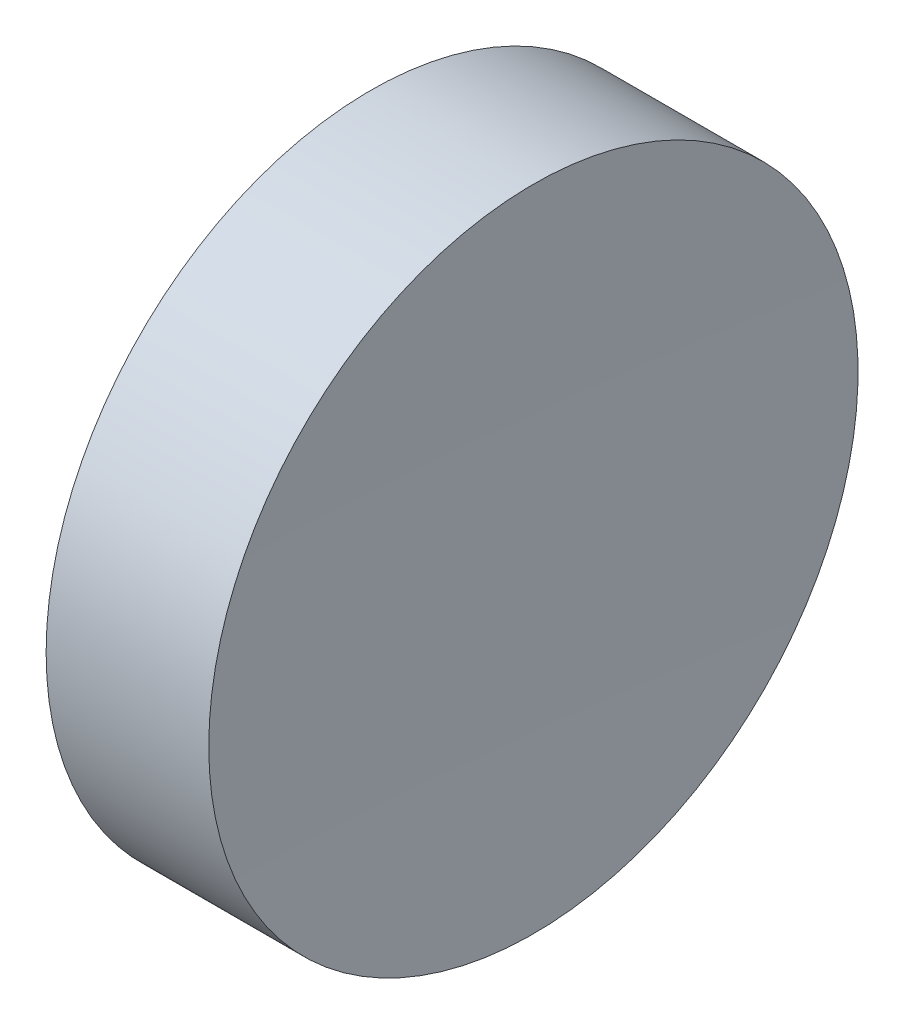
ISO-10303-21;
HEADER;
FILE_DESCRIPTION(('STEP AP214'),'2;1');
FILE_NAME('part.step','',(''),(''),'','','');
FILE_SCHEMA(('AUTOMOTIVE_DESIGN { 1 0 10303 214 1 1 1 1 }'));
ENDSEC;
DATA;
#1=APPLICATION_CONTEXT('core data for automotive mechanical design processes');
#2=APPLICATION_PROTOCOL_DEFINITION('international standard','automotive_design',2000,#1);
#3=PRODUCT_CONTEXT('',#1,'mechanical');
#4=PRODUCT('Part','Part','',(#3));
#5=PRODUCT_RELATED_PRODUCT_CATEGORY('part','',(#4));
#6=PRODUCT_DEFINITION_FORMATION('','',#4);
#7=PRODUCT_DEFINITION_CONTEXT('part definition',#1,'design');
#8=PRODUCT_DEFINITION('design','',#6,#7);
#9=PRODUCT_DEFINITION_SHAPE('','',#8);
#10=(LENGTH_UNIT() NAMED_UNIT(*) SI_UNIT(.MILLI.,.METRE.));
#11=(NAMED_UNIT(*) PLANE_ANGLE_UNIT() SI_UNIT($,.RADIAN.));
#12=(NAMED_UNIT(*) SI_UNIT($,.STERADIAN.) SOLID_ANGLE_UNIT());
#13=UNCERTAINTY_MEASURE_WITH_UNIT(LENGTH_MEASURE(1.E-05),#10,'distance_accuracy_value','');
#14=(GEOMETRIC_REPRESENTATION_CONTEXT(3) GLOBAL_UNCERTAINTY_ASSIGNED_CONTEXT((#13)) GLOBAL_UNIT_ASSIGNED_CONTEXT((#10,
#11,#12)) REPRESENTATION_CONTEXT('',''));
#15=CARTESIAN_POINT('',(0.,0.,0.));
#16=DIRECTION('',(0.,0.,1.));
#17=DIRECTION('',(1.,0.,0.));
#18=AXIS2_PLACEMENT_3D('',#15,#16,#17);
#19=CARTESIAN_POINT('',(0.,0.,0.));
#20=DIRECTION('',(1.,0.,0.));
#21=DIRECTION('',(0.,0.,-1.));
#22=AXIS2_PLACEMENT_3D('',#19,#20,#21);
#23=PLANE('',#22);
#24=CARTESIAN_POINT('',(0.,0.,0.));
#25=DIRECTION('',(-1.,0.,0.));
#26=DIRECTION('',(0.,0.,1.));
#27=AXIS2_PLACEMENT_3D('',#24,#25,#26);
#28=CIRCLE('',#27,6.35);
#29=CARTESIAN_POINT('',(0.,0.,6.35));
#30=VERTEX_POINT('',#29);
#31=EDGE_CURVE('E39',#30,#30,#28,.T.);
#32=ORIENTED_EDGE('',*,*,#31,.T.);
#33=EDGE_LOOP('',(#32));
#34=FACE_BOUND('',#33,.T.);
#35=ADVANCED_FACE('F33',(#34),#23,.F.);
#36=CARTESIAN_POINT('',(203.08,0.,0.));
#37=DIRECTION('',(-1.,0.,0.));
#38=DIRECTION('',(0.,0.,1.));
#39=AXIS2_PLACEMENT_3D('',#36,#37,#38);
#40=SPHERICAL_SURFACE('',#39,200.);
#41=CARTESIAN_POINT('',(3.18083166756297,0.,0.));
#42=DIRECTION('',(-1.,0.,0.));
#43=DIRECTION('',(0.,0.,1.));
#44=AXIS2_PLACEMENT_3D('',#41,#42,#43);
#45=CIRCLE('',#44,6.35000000000011);
#46=CARTESIAN_POINT('',(3.18083166756297,0.,6.35000000000011));
#47=VERTEX_POINT('',#46);
#48=EDGE_CURVE('E10',#47,#47,#45,.T.);
#49=ORIENTED_EDGE('',*,*,#48,.F.);
#50=EDGE_LOOP('',(#49));
#51=FACE_BOUND('',#50,.T.);
#52=ADVANCED_FACE('F48',(#51),#40,.F.);
#53=CARTESIAN_POINT('',(0.,0.,0.));
#54=DIRECTION('',(-1.,0.,0.));
#55=DIRECTION('',(0.,0.,1.));
#56=AXIS2_PLACEMENT_3D('',#53,#54,#55);
#57=CYLINDRICAL_SURFACE('',#56,6.35000000000005);
#58=ORIENTED_EDGE('',*,*,#31,.F.);
#59=EDGE_LOOP('',(#58));
#60=FACE_BOUND('',#59,.T.);
#61=ORIENTED_EDGE('',*,*,#48,.T.);
#62=EDGE_LOOP('',(#61));
#63=FACE_BOUND('',#62,.T.);
#64=ADVANCED_FACE('F46',(#60,#63),#57,.T.);
#65=CLOSED_SHELL('',(#35,#52,#64));
#66=MANIFOLD_SOLID_BREP('B2',#65);
#67=ADVANCED_BREP_SHAPE_REPRESENTATION('',(#18,#66),#14);
#68=SHAPE_DEFINITION_REPRESENTATION(#9,#67);
ENDSEC;
END-ISO-10303-21;
